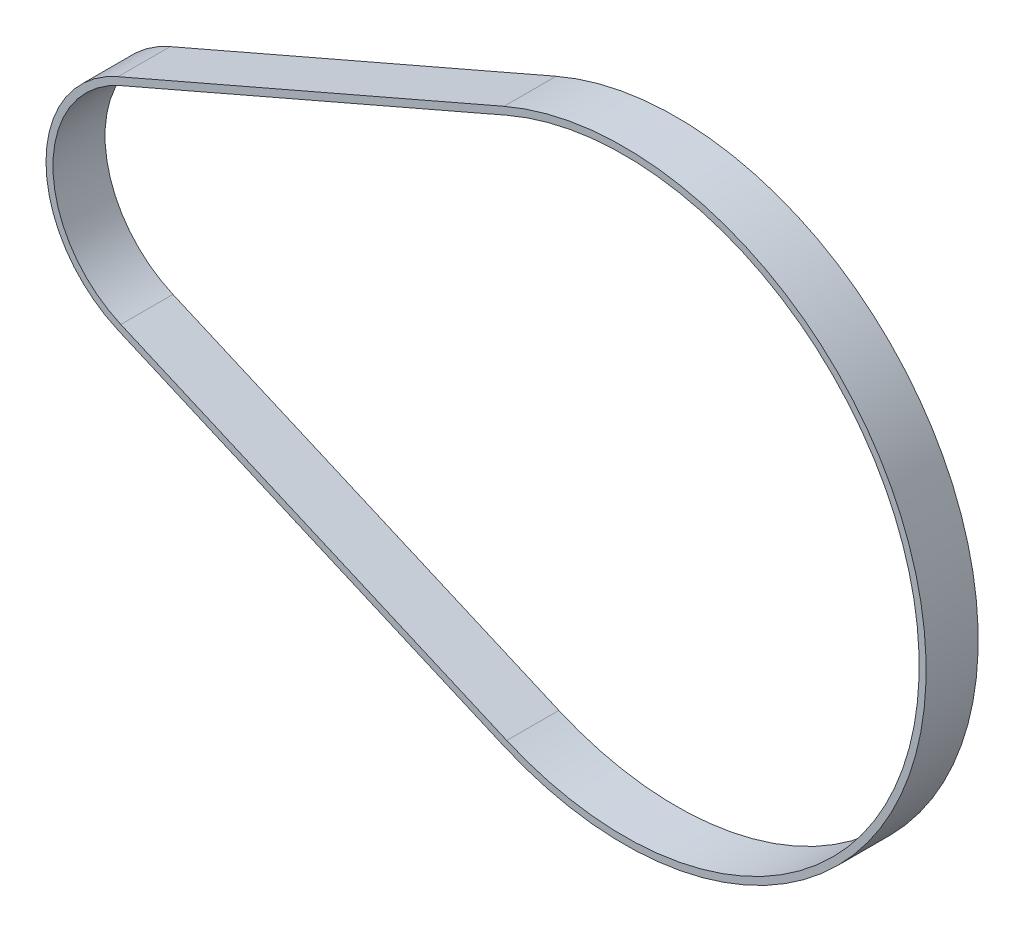
ISO-10303-21;
HEADER;
FILE_DESCRIPTION(('STEP AP214'),'2;1');
FILE_NAME('part.step','',(''),(''),'','','');
FILE_SCHEMA(('AUTOMOTIVE_DESIGN { 1 0 10303 214 1 1 1 1 }'));
ENDSEC;
DATA;
#1=APPLICATION_CONTEXT('core data for automotive mechanical design processes');
#2=APPLICATION_PROTOCOL_DEFINITION('international standard','automotive_design',2000,#1);
#3=PRODUCT_CONTEXT('',#1,'mechanical');
#4=PRODUCT('Part','Part','',(#3));
#5=PRODUCT_RELATED_PRODUCT_CATEGORY('part','',(#4));
#6=PRODUCT_DEFINITION_FORMATION('','',#4);
#7=PRODUCT_DEFINITION_CONTEXT('part definition',#1,'design');
#8=PRODUCT_DEFINITION('design','',#6,#7);
#9=PRODUCT_DEFINITION_SHAPE('','',#8);
#10=(LENGTH_UNIT() NAMED_UNIT(*) SI_UNIT(.MILLI.,.METRE.));
#11=(NAMED_UNIT(*) PLANE_ANGLE_UNIT() SI_UNIT($,.RADIAN.));
#12=(NAMED_UNIT(*) SI_UNIT($,.STERADIAN.) SOLID_ANGLE_UNIT());
#13=UNCERTAINTY_MEASURE_WITH_UNIT(LENGTH_MEASURE(1.E-05),#10,'distance_accuracy_value','');
#14=(GEOMETRIC_REPRESENTATION_CONTEXT(3) GLOBAL_UNCERTAINTY_ASSIGNED_CONTEXT((#13)) GLOBAL_UNIT_ASSIGNED_CONTEXT((#10,
#11,#12)) REPRESENTATION_CONTEXT('',''));
#15=CARTESIAN_POINT('',(0.,0.,0.));
#16=DIRECTION('',(0.,0.,1.));
#17=DIRECTION('',(1.,0.,0.));
#18=AXIS2_PLACEMENT_3D('',#15,#16,#17);
#19=CARTESIAN_POINT('',(5.16947595841089E-13,0.,3.));
#20=DIRECTION('',(0.,0.,1.));
#21=DIRECTION('',(1.,0.,0.));
#22=AXIS2_PLACEMENT_3D('',#19,#20,#21);
#23=PLANE('',#22);
#24=CARTESIAN_POINT('',(5.16947595841089E-13,0.,3.));
#25=DIRECTION('',(0.,0.,1.));
#26=DIRECTION('',(1.,0.,0.));
#27=AXIS2_PLACEMENT_3D('',#24,#25,#26);
#28=CIRCLE('',#27,13.7880150000005);
#29=CARTESIAN_POINT('',(-5.4839995872167,12.650498257683,3.));
#30=VERTEX_POINT('',#29);
#31=CARTESIAN_POINT('',(-5.4839995872167,-12.650498257683,3.));
#32=VERTEX_POINT('',#31);
#33=EDGE_CURVE('E110',#30,#32,#28,.T.);
#34=ORIENTED_EDGE('',*,*,#33,.T.);
#35=DIRECTION('',(0.917499600753454,-0.397736700113596,0.));
#36=VECTOR('',#35,1.);
#37=CARTESIAN_POINT('',(-5.4839995872167,-12.650498257683,3.));
#38=LINE('',#37,#36);
#39=CARTESIAN_POINT('',(38.98016784094,-31.925745038881,3.));
#40=VERTEX_POINT('',#39);
#41=EDGE_CURVE('E153',#32,#40,#38,.T.);
#42=ORIENTED_EDGE('',*,*,#41,.T.);
#43=CARTESIAN_POINT('',(52.8199999999997,0.,3.));
#44=DIRECTION('',(0.,0.,1.));
#45=DIRECTION('',(1.,0.,0.));
#46=AXIS2_PLACEMENT_3D('',#43,#44,#45);
#47=CIRCLE('',#46,34.7964675000003);
#48=CARTESIAN_POINT('',(38.98016784094,31.925745038881,3.));
#49=VERTEX_POINT('',#48);
#50=EDGE_CURVE('E155',#40,#49,#47,.T.);
#51=ORIENTED_EDGE('',*,*,#50,.T.);
#52=DIRECTION('',(-0.917499600753454,-0.397736700113596,0.));
#53=VECTOR('',#52,1.);
#54=CARTESIAN_POINT('',(38.98016784094,31.925745038881,3.));
#55=LINE('',#54,#53);
#56=EDGE_CURVE('E57',#49,#30,#55,.T.);
#57=ORIENTED_EDGE('',*,*,#56,.T.);
#58=EDGE_LOOP('',(#34,#42,#51,#57));
#59=FACE_BOUND('',#58,.T.);
#60=DIRECTION('',(0.917499600753455,-0.397736700113594,0.));
#61=VECTOR('',#60,1.);
#62=CARTESIAN_POINT('',(-5.1658102271259,-11.91649857708,3.));
#63=LINE('',#62,#61);
#64=CARTESIAN_POINT('',(-5.1658102271259,-11.91649857708,3.));
#65=VERTEX_POINT('',#64);
#66=CARTESIAN_POINT('',(39.298357201031,-31.191745358278,3.));
#67=VERTEX_POINT('',#66);
#68=EDGE_CURVE('E142',#65,#67,#63,.T.);
#69=ORIENTED_EDGE('',*,*,#68,.F.);
#70=CARTESIAN_POINT('',(5.16947595841089E-13,0.,3.));
#71=DIRECTION('',(0.,0.,1.));
#72=DIRECTION('',(1.,0.,0.));
#73=AXIS2_PLACEMENT_3D('',#70,#71,#72);
#74=CIRCLE('',#73,12.9880150000003);
#75=CARTESIAN_POINT('',(-5.1658102271259,11.91649857708,3.));
#76=VERTEX_POINT('',#75);
#77=EDGE_CURVE('E107',#76,#65,#74,.T.);
#78=ORIENTED_EDGE('',*,*,#77,.F.);
#79=DIRECTION('',(-0.917499600753455,-0.397736700113594,0.));
#80=VECTOR('',#79,1.);
#81=CARTESIAN_POINT('',(39.298357201031,31.191745358278,3.));
#82=LINE('',#81,#80);
#83=CARTESIAN_POINT('',(39.298357201031,31.191745358278,3.));
#84=VERTEX_POINT('',#83);
#85=EDGE_CURVE('E146',#84,#76,#82,.T.);
#86=ORIENTED_EDGE('',*,*,#85,.F.);
#87=CARTESIAN_POINT('',(52.8199999999997,0.,3.));
#88=DIRECTION('',(0.,0.,1.));
#89=DIRECTION('',(1.,0.,0.));
#90=AXIS2_PLACEMENT_3D('',#87,#88,#89);
#91=CIRCLE('',#90,33.9964675);
#92=EDGE_CURVE('E144',#67,#84,#91,.T.);
#93=ORIENTED_EDGE('',*,*,#92,.F.);
#94=EDGE_LOOP('',(#69,#78,#86,#93));
#95=FACE_BOUND('',#94,.T.);
#96=ADVANCED_FACE('F34',(#59,#95),#23,.T.);
#97=CARTESIAN_POINT('',(5.16947595841089E-13,0.,3.));
#98=DIRECTION('',(0.,0.,-1.));
#99=DIRECTION('',(-1.,0.,0.));
#100=AXIS2_PLACEMENT_3D('',#97,#98,#99);
#101=CYLINDRICAL_SURFACE('',#100,13.7880150000005);
#102=DIRECTION('',(0.,0.,-1.));
#103=VECTOR('',#102,1.);
#104=CARTESIAN_POINT('',(-5.4839995872167,12.650498257683,3.));
#105=LINE('',#104,#103);
#106=CARTESIAN_POINT('',(-5.4839995872167,12.650498257683,-3.));
#107=VERTEX_POINT('',#106);
#108=EDGE_CURVE('E158',#30,#107,#105,.T.);
#109=ORIENTED_EDGE('',*,*,#108,.T.);
#110=CARTESIAN_POINT('',(5.16947595841089E-13,0.,-3.));
#111=DIRECTION('',(0.,0.,1.));
#112=DIRECTION('',(1.,0.,0.));
#113=AXIS2_PLACEMENT_3D('',#110,#111,#112);
#114=CIRCLE('',#113,13.7880150000005);
#115=CARTESIAN_POINT('',(-5.4839995872167,-12.650498257683,-3.));
#116=VERTEX_POINT('',#115);
#117=EDGE_CURVE('E129',#107,#116,#114,.T.);
#118=ORIENTED_EDGE('',*,*,#117,.T.);
#119=DIRECTION('',(0.,0.,-1.));
#120=VECTOR('',#119,1.);
#121=CARTESIAN_POINT('',(-5.4839995872167,-12.650498257683,3.));
#122=LINE('',#121,#120);
#123=EDGE_CURVE('E11',#32,#116,#122,.T.);
#124=ORIENTED_EDGE('',*,*,#123,.F.);
#125=ORIENTED_EDGE('',*,*,#33,.F.);
#126=EDGE_LOOP('',(#109,#118,#124,#125));
#127=FACE_BOUND('',#126,.T.);
#128=ADVANCED_FACE('F36',(#127),#101,.T.);
#129=CARTESIAN_POINT('',(-5.4839995872167,-12.650498257683,3.));
#130=DIRECTION('',(0.397736700113596,0.917499600753454,0.));
#131=DIRECTION('',(-0.917499600753454,0.397736700113596,0.));
#132=AXIS2_PLACEMENT_3D('',#129,#130,#131);
#133=PLANE('',#132);
#134=ORIENTED_EDGE('',*,*,#123,.T.);
#135=DIRECTION('',(0.917499600753454,-0.397736700113596,0.));
#136=VECTOR('',#135,1.);
#137=CARTESIAN_POINT('',(-5.4839995872167,-12.650498257683,-3.));
#138=LINE('',#137,#136);
#139=CARTESIAN_POINT('',(38.98016784094,-31.925745038881,-3.));
#140=VERTEX_POINT('',#139);
#141=EDGE_CURVE('E132',#116,#140,#138,.T.);
#142=ORIENTED_EDGE('',*,*,#141,.T.);
#143=DIRECTION('',(0.,0.,-1.));
#144=VECTOR('',#143,1.);
#145=CARTESIAN_POINT('',(38.98016784094,-31.925745038881,3.));
#146=LINE('',#145,#144);
#147=EDGE_CURVE('E42',#40,#140,#146,.T.);
#148=ORIENTED_EDGE('',*,*,#147,.F.);
#149=ORIENTED_EDGE('',*,*,#41,.F.);
#150=EDGE_LOOP('',(#134,#142,#148,#149));
#151=FACE_BOUND('',#150,.T.);
#152=ADVANCED_FACE('F171',(#151),#133,.F.);
#153=CARTESIAN_POINT('',(52.8199999999997,0.,3.));
#154=DIRECTION('',(0.,0.,-1.));
#155=DIRECTION('',(-1.,0.,0.));
#156=AXIS2_PLACEMENT_3D('',#153,#154,#155);
#157=CYLINDRICAL_SURFACE('',#156,34.7964675000003);
#158=ORIENTED_EDGE('',*,*,#147,.T.);
#159=CARTESIAN_POINT('',(52.8199999999997,0.,-3.));
#160=DIRECTION('',(0.,0.,1.));
#161=DIRECTION('',(1.,0.,0.));
#162=AXIS2_PLACEMENT_3D('',#159,#160,#161);
#163=CIRCLE('',#162,34.7964675000003);
#164=CARTESIAN_POINT('',(38.98016784094,31.925745038881,-3.));
#165=VERTEX_POINT('',#164);
#166=EDGE_CURVE('E135',#140,#165,#163,.T.);
#167=ORIENTED_EDGE('',*,*,#166,.T.);
#168=DIRECTION('',(0.,0.,-1.));
#169=VECTOR('',#168,1.);
#170=CARTESIAN_POINT('',(38.98016784094,31.925745038881,3.));
#171=LINE('',#170,#169);
#172=EDGE_CURVE('E160',#49,#165,#171,.T.);
#173=ORIENTED_EDGE('',*,*,#172,.F.);
#174=ORIENTED_EDGE('',*,*,#50,.F.);
#175=EDGE_LOOP('',(#158,#167,#173,#174));
#176=FACE_BOUND('',#175,.T.);
#177=ADVANCED_FACE('F165',(#176),#157,.T.);
#178=CARTESIAN_POINT('',(38.98016784094,31.925745038881,3.));
#179=DIRECTION('',(0.397736700113596,-0.917499600753454,0.));
#180=DIRECTION('',(0.917499600753454,0.397736700113596,0.));
#181=AXIS2_PLACEMENT_3D('',#178,#179,#180);
#182=PLANE('',#181);
#183=ORIENTED_EDGE('',*,*,#172,.T.);
#184=DIRECTION('',(-0.917499600753454,-0.397736700113596,0.));
#185=VECTOR('',#184,1.);
#186=CARTESIAN_POINT('',(38.98016784094,31.925745038881,-3.));
#187=LINE('',#186,#185);
#188=EDGE_CURVE('E138',#165,#107,#187,.T.);
#189=ORIENTED_EDGE('',*,*,#188,.T.);
#190=ORIENTED_EDGE('',*,*,#108,.F.);
#191=ORIENTED_EDGE('',*,*,#56,.F.);
#192=EDGE_LOOP('',(#183,#189,#190,#191));
#193=FACE_BOUND('',#192,.T.);
#194=ADVANCED_FACE('F176',(#193),#182,.F.);
#195=CARTESIAN_POINT('',(5.16947595841089E-13,0.,3.));
#196=DIRECTION('',(0.,0.,-1.));
#197=DIRECTION('',(-1.,0.,0.));
#198=AXIS2_PLACEMENT_3D('',#195,#196,#197);
#199=CYLINDRICAL_SURFACE('',#198,12.9880150000003);
#200=DIRECTION('',(0.,0.,-1.));
#201=VECTOR('',#200,1.);
#202=CARTESIAN_POINT('',(-5.1658102271259,-11.91649857708,3.));
#203=LINE('',#202,#201);
#204=CARTESIAN_POINT('',(-5.1658102271259,-11.91649857708,-3.));
#205=VERTEX_POINT('',#204);
#206=EDGE_CURVE('E99',#65,#205,#203,.T.);
#207=ORIENTED_EDGE('',*,*,#206,.T.);
#208=CARTESIAN_POINT('',(5.16947595841089E-13,0.,-3.));
#209=DIRECTION('',(0.,0.,1.));
#210=DIRECTION('',(1.,0.,0.));
#211=AXIS2_PLACEMENT_3D('',#208,#209,#210);
#212=CIRCLE('',#211,12.9880150000003);
#213=CARTESIAN_POINT('',(-5.1658102271259,11.91649857708,-3.));
#214=VERTEX_POINT('',#213);
#215=EDGE_CURVE('E104',#214,#205,#212,.T.);
#216=ORIENTED_EDGE('',*,*,#215,.F.);
#217=DIRECTION('',(0.,0.,-1.));
#218=VECTOR('',#217,1.);
#219=CARTESIAN_POINT('',(-5.1658102271259,11.91649857708,3.));
#220=LINE('',#219,#218);
#221=EDGE_CURVE('E148',#76,#214,#220,.T.);
#222=ORIENTED_EDGE('',*,*,#221,.F.);
#223=ORIENTED_EDGE('',*,*,#77,.T.);
#224=EDGE_LOOP('',(#207,#216,#222,#223));
#225=FACE_BOUND('',#224,.T.);
#226=ADVANCED_FACE('F101',(#225),#199,.F.);
#227=CARTESIAN_POINT('',(-5.1658102271259,-11.91649857708,3.));
#228=DIRECTION('',(0.397736700113594,0.917499600753455,0.));
#229=DIRECTION('',(-0.917499600753455,0.397736700113594,0.));
#230=AXIS2_PLACEMENT_3D('',#227,#228,#229);
#231=PLANE('',#230);
#232=DIRECTION('',(0.,0.,-1.));
#233=VECTOR('',#232,1.);
#234=CARTESIAN_POINT('',(39.298357201031,-31.191745358278,3.));
#235=LINE('',#234,#233);
#236=CARTESIAN_POINT('',(39.298357201031,-31.191745358278,-3.));
#237=VERTEX_POINT('',#236);
#238=EDGE_CURVE('E111',#67,#237,#235,.T.);
#239=ORIENTED_EDGE('',*,*,#238,.T.);
#240=DIRECTION('',(0.917499600753455,-0.397736700113594,0.));
#241=VECTOR('',#240,1.);
#242=CARTESIAN_POINT('',(-5.1658102271259,-11.91649857708,-3.));
#243=LINE('',#242,#241);
#244=EDGE_CURVE('E114',#205,#237,#243,.T.);
#245=ORIENTED_EDGE('',*,*,#244,.F.);
#246=ORIENTED_EDGE('',*,*,#206,.F.);
#247=ORIENTED_EDGE('',*,*,#68,.T.);
#248=EDGE_LOOP('',(#239,#245,#246,#247));
#249=FACE_BOUND('',#248,.T.);
#250=ADVANCED_FACE('F115',(#249),#231,.T.);
#251=CARTESIAN_POINT('',(52.8199999999997,0.,3.));
#252=DIRECTION('',(0.,0.,-1.));
#253=DIRECTION('',(-1.,0.,0.));
#254=AXIS2_PLACEMENT_3D('',#251,#252,#253);
#255=CYLINDRICAL_SURFACE('',#254,33.9964675);
#256=DIRECTION('',(0.,0.,-1.));
#257=VECTOR('',#256,1.);
#258=CARTESIAN_POINT('',(39.298357201031,31.191745358278,3.));
#259=LINE('',#258,#257);
#260=CARTESIAN_POINT('',(39.298357201031,31.191745358278,-3.));
#261=VERTEX_POINT('',#260);
#262=EDGE_CURVE('E49',#84,#261,#259,.T.);
#263=ORIENTED_EDGE('',*,*,#262,.T.);
#264=CARTESIAN_POINT('',(52.8199999999997,0.,-3.));
#265=DIRECTION('',(0.,0.,1.));
#266=DIRECTION('',(1.,0.,0.));
#267=AXIS2_PLACEMENT_3D('',#264,#265,#266);
#268=CIRCLE('',#267,33.9964675);
#269=EDGE_CURVE('E120',#237,#261,#268,.T.);
#270=ORIENTED_EDGE('',*,*,#269,.F.);
#271=ORIENTED_EDGE('',*,*,#238,.F.);
#272=ORIENTED_EDGE('',*,*,#92,.T.);
#273=EDGE_LOOP('',(#263,#270,#271,#272));
#274=FACE_BOUND('',#273,.T.);
#275=ADVANCED_FACE('F194',(#274),#255,.F.);
#276=CARTESIAN_POINT('',(39.298357201031,31.191745358278,3.));
#277=DIRECTION('',(0.397736700113594,-0.917499600753455,0.));
#278=DIRECTION('',(0.917499600753455,0.397736700113594,0.));
#279=AXIS2_PLACEMENT_3D('',#276,#277,#278);
#280=PLANE('',#279);
#281=ORIENTED_EDGE('',*,*,#221,.T.);
#282=DIRECTION('',(-0.917499600753455,-0.397736700113594,0.));
#283=VECTOR('',#282,1.);
#284=CARTESIAN_POINT('',(39.298357201031,31.191745358278,-3.));
#285=LINE('',#284,#283);
#286=EDGE_CURVE('E124',#261,#214,#285,.T.);
#287=ORIENTED_EDGE('',*,*,#286,.F.);
#288=ORIENTED_EDGE('',*,*,#262,.F.);
#289=ORIENTED_EDGE('',*,*,#85,.T.);
#290=EDGE_LOOP('',(#281,#287,#288,#289));
#291=FACE_BOUND('',#290,.T.);
#292=ADVANCED_FACE('F197',(#291),#280,.T.);
#293=CARTESIAN_POINT('',(5.16947595841089E-13,0.,-3.));
#294=DIRECTION('',(0.,0.,1.));
#295=DIRECTION('',(1.,0.,0.));
#296=AXIS2_PLACEMENT_3D('',#293,#294,#295);
#297=PLANE('',#296);
#298=ORIENTED_EDGE('',*,*,#286,.T.);
#299=ORIENTED_EDGE('',*,*,#215,.T.);
#300=ORIENTED_EDGE('',*,*,#244,.T.);
#301=ORIENTED_EDGE('',*,*,#269,.T.);
#302=EDGE_LOOP('',(#298,#299,#300,#301));
#303=FACE_BOUND('',#302,.T.);
#304=ORIENTED_EDGE('',*,*,#117,.F.);
#305=ORIENTED_EDGE('',*,*,#188,.F.);
#306=ORIENTED_EDGE('',*,*,#166,.F.);
#307=ORIENTED_EDGE('',*,*,#141,.F.);
#308=EDGE_LOOP('',(#304,#305,#306,#307));
#309=FACE_BOUND('',#308,.T.);
#310=ADVANCED_FACE('F122',(#303,#309),#297,.F.);
#311=CLOSED_SHELL('',(#96,#128,#152,#177,#194,#226,#250,#275,#292,#310));
#312=MANIFOLD_SOLID_BREP('B2',#311);
#313=ADVANCED_BREP_SHAPE_REPRESENTATION('',(#18,#312),#14);
#314=SHAPE_DEFINITION_REPRESENTATION(#9,#313);
ENDSEC;
END-ISO-10303-21;
